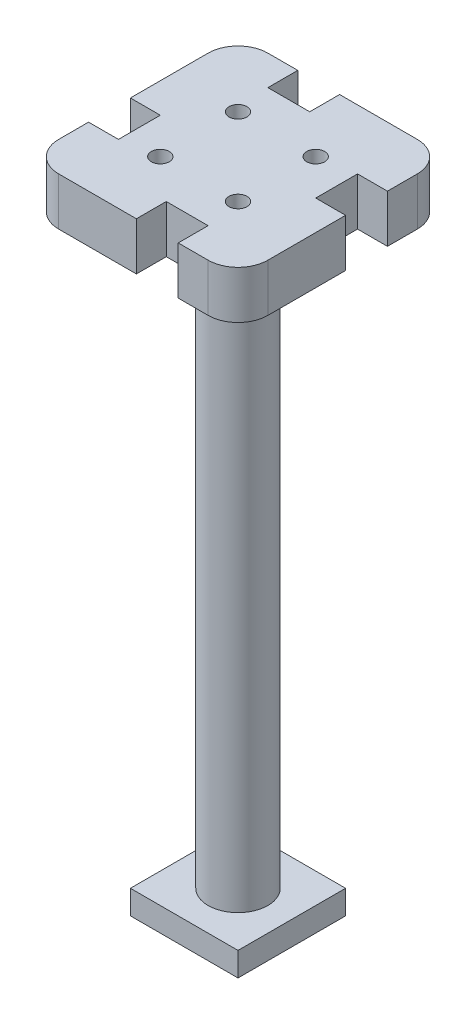
ISO-10303-21;
HEADER;
FILE_DESCRIPTION(('STEP AP214'),'2;1');
FILE_NAME('part.step','',(''),(''),'','','');
FILE_SCHEMA(('AUTOMOTIVE_DESIGN { 1 0 10303 214 1 1 1 1 }'));
ENDSEC;
DATA;
#1=APPLICATION_CONTEXT('core data for automotive mechanical design processes');
#2=APPLICATION_PROTOCOL_DEFINITION('international standard','automotive_design',2000,#1);
#3=PRODUCT_CONTEXT('',#1,'mechanical');
#4=PRODUCT('Part','Part','',(#3));
#5=PRODUCT_RELATED_PRODUCT_CATEGORY('part','',(#4));
#6=PRODUCT_DEFINITION_FORMATION('','',#4);
#7=PRODUCT_DEFINITION_CONTEXT('part definition',#1,'design');
#8=PRODUCT_DEFINITION('design','',#6,#7);
#9=PRODUCT_DEFINITION_SHAPE('','',#8);
#10=(LENGTH_UNIT() NAMED_UNIT(*) SI_UNIT(.MILLI.,.METRE.));
#11=(NAMED_UNIT(*) PLANE_ANGLE_UNIT() SI_UNIT($,.RADIAN.));
#12=(NAMED_UNIT(*) SI_UNIT($,.STERADIAN.) SOLID_ANGLE_UNIT());
#13=UNCERTAINTY_MEASURE_WITH_UNIT(LENGTH_MEASURE(1.E-05),#10,'distance_accuracy_value','');
#14=(GEOMETRIC_REPRESENTATION_CONTEXT(3) GLOBAL_UNCERTAINTY_ASSIGNED_CONTEXT((#13)) GLOBAL_UNIT_ASSIGNED_CONTEXT((#10,
#11,#12)) REPRESENTATION_CONTEXT('',''));
#15=CARTESIAN_POINT('',(0.,0.,0.));
#16=DIRECTION('',(0.,0.,1.));
#17=DIRECTION('',(1.,0.,0.));
#18=AXIS2_PLACEMENT_3D('',#15,#16,#17);
#19=CARTESIAN_POINT('',(0.,8.,0.));
#20=DIRECTION('',(1.,0.,0.));
#21=DIRECTION('',(0.,0.,-1.));
#22=AXIS2_PLACEMENT_3D('',#19,#20,#21);
#23=PLANE('',#22);
#24=DIRECTION('',(0.,0.,1.));
#25=VECTOR('',#24,1.);
#26=CARTESIAN_POINT('',(0.,0.,0.));
#27=LINE('',#26,#25);
#28=CARTESIAN_POINT('',(0.,0.,-10.));
#29=VERTEX_POINT('',#28);
#30=CARTESIAN_POINT('',(0.,0.,-5.));
#31=VERTEX_POINT('',#30);
#32=EDGE_CURVE('E296',#29,#31,#27,.T.);
#33=ORIENTED_EDGE('',*,*,#32,.T.);
#34=DIRECTION('',(0.,-1.,0.));
#35=VECTOR('',#34,1.);
#36=CARTESIAN_POINT('',(0.,8.,-5.));
#37=LINE('',#36,#35);
#38=CARTESIAN_POINT('',(0.,8.,-5.));
#39=VERTEX_POINT('',#38);
#40=EDGE_CURVE('E11',#31,#39,#37,.F.);
#41=ORIENTED_EDGE('',*,*,#40,.T.);
#42=DIRECTION('',(0.,0.,1.));
#43=VECTOR('',#42,1.);
#44=CARTESIAN_POINT('',(0.,8.,0.));
#45=LINE('',#44,#43);
#46=CARTESIAN_POINT('',(0.,8.,-10.));
#47=VERTEX_POINT('',#46);
#48=EDGE_CURVE('E409',#47,#39,#45,.T.);
#49=ORIENTED_EDGE('',*,*,#48,.F.);
#50=DIRECTION('',(0.,-1.,0.));
#51=VECTOR('',#50,1.);
#52=CARTESIAN_POINT('',(0.,8.,-10.));
#53=LINE('',#52,#51);
#54=EDGE_CURVE('E401',#47,#29,#53,.T.);
#55=ORIENTED_EDGE('',*,*,#54,.T.);
#56=EDGE_LOOP('',(#33,#41,#49,#55));
#57=FACE_BOUND('',#56,.T.);
#58=ADVANCED_FACE('F41',(#57),#23,.F.);
#59=CARTESIAN_POINT('',(0.,8.,0.));
#60=DIRECTION('',(0.,0.,-1.));
#61=DIRECTION('',(-1.,0.,0.));
#62=AXIS2_PLACEMENT_3D('',#59,#60,#61);
#63=PLANE('',#62);
#64=DIRECTION('',(1.,0.,0.));
#65=VECTOR('',#64,1.);
#66=CARTESIAN_POINT('',(0.,0.,0.));
#67=LINE('',#66,#65);
#68=CARTESIAN_POINT('',(25.,0.,0.));
#69=VERTEX_POINT('',#68);
#70=CARTESIAN_POINT('',(30.,0.,0.));
#71=VERTEX_POINT('',#70);
#72=EDGE_CURVE('E421',#69,#71,#67,.T.);
#73=ORIENTED_EDGE('',*,*,#72,.T.);
#74=DIRECTION('',(0.,-1.,0.));
#75=VECTOR('',#74,1.);
#76=CARTESIAN_POINT('',(30.,8.,0.));
#77=LINE('',#76,#75);
#78=CARTESIAN_POINT('',(30.,8.,0.));
#79=VERTEX_POINT('',#78);
#80=EDGE_CURVE('E440',#71,#79,#77,.F.);
#81=ORIENTED_EDGE('',*,*,#80,.T.);
#82=DIRECTION('',(1.,0.,0.));
#83=VECTOR('',#82,1.);
#84=CARTESIAN_POINT('',(0.,8.,0.));
#85=LINE('',#84,#83);
#86=CARTESIAN_POINT('',(25.,8.,0.));
#87=VERTEX_POINT('',#86);
#88=EDGE_CURVE('E408',#87,#79,#85,.T.);
#89=ORIENTED_EDGE('',*,*,#88,.F.);
#90=DIRECTION('',(0.,-1.,0.));
#91=VECTOR('',#90,1.);
#92=CARTESIAN_POINT('',(25.,8.,0.));
#93=LINE('',#92,#91);
#94=EDGE_CURVE('E331',#87,#69,#93,.T.);
#95=ORIENTED_EDGE('',*,*,#94,.T.);
#96=EDGE_LOOP('',(#73,#81,#89,#95));
#97=FACE_BOUND('',#96,.T.);
#98=ADVANCED_FACE('F488',(#97),#63,.F.);
#99=CARTESIAN_POINT('',(35.,8.,0.));
#100=DIRECTION('',(-1.,0.,0.));
#101=DIRECTION('',(0.,0.,1.));
#102=AXIS2_PLACEMENT_3D('',#99,#100,#101);
#103=PLANE('',#102);
#104=DIRECTION('',(0.,0.,-1.));
#105=VECTOR('',#104,1.);
#106=CARTESIAN_POINT('',(35.,0.,0.));
#107=LINE('',#106,#105);
#108=CARTESIAN_POINT('',(35.,0.,-25.));
#109=VERTEX_POINT('',#108);
#110=CARTESIAN_POINT('',(35.,0.,-30.));
#111=VERTEX_POINT('',#110);
#112=EDGE_CURVE('E424',#109,#111,#107,.T.);
#113=ORIENTED_EDGE('',*,*,#112,.T.);
#114=DIRECTION('',(0.,-1.,0.));
#115=VECTOR('',#114,1.);
#116=CARTESIAN_POINT('',(35.,8.,-30.));
#117=LINE('',#116,#115);
#118=CARTESIAN_POINT('',(35.,8.,-30.));
#119=VERTEX_POINT('',#118);
#120=EDGE_CURVE('E452',#111,#119,#117,.F.);
#121=ORIENTED_EDGE('',*,*,#120,.T.);
#122=DIRECTION('',(0.,0.,-1.));
#123=VECTOR('',#122,1.);
#124=CARTESIAN_POINT('',(35.,8.,0.));
#125=LINE('',#124,#123);
#126=CARTESIAN_POINT('',(35.,8.,-25.));
#127=VERTEX_POINT('',#126);
#128=EDGE_CURVE('E412',#127,#119,#125,.T.);
#129=ORIENTED_EDGE('',*,*,#128,.F.);
#130=DIRECTION('',(0.,-1.,0.));
#131=VECTOR('',#130,1.);
#132=CARTESIAN_POINT('',(35.,8.,-25.));
#133=LINE('',#132,#131);
#134=EDGE_CURVE('E297',#127,#109,#133,.T.);
#135=ORIENTED_EDGE('',*,*,#134,.T.);
#136=EDGE_LOOP('',(#113,#121,#129,#135));
#137=FACE_BOUND('',#136,.T.);
#138=ADVANCED_FACE('F514',(#137),#103,.F.);
#139=CARTESIAN_POINT('',(0.,8.,-35.));
#140=DIRECTION('',(0.,0.,1.));
#141=DIRECTION('',(1.,0.,0.));
#142=AXIS2_PLACEMENT_3D('',#139,#140,#141);
#143=PLANE('',#142);
#144=DIRECTION('',(-1.,0.,0.));
#145=VECTOR('',#144,1.);
#146=CARTESIAN_POINT('',(0.,0.,-35.));
#147=LINE('',#146,#145);
#148=CARTESIAN_POINT('',(9.99999999999999,0.,-35.));
#149=VERTEX_POINT('',#148);
#150=CARTESIAN_POINT('',(4.99999999999999,0.,-35.));
#151=VERTEX_POINT('',#150);
#152=EDGE_CURVE('E427',#149,#151,#147,.T.);
#153=ORIENTED_EDGE('',*,*,#152,.T.);
#154=DIRECTION('',(0.,-1.,0.));
#155=VECTOR('',#154,1.);
#156=CARTESIAN_POINT('',(4.99999999999999,8.,-35.));
#157=LINE('',#156,#155);
#158=CARTESIAN_POINT('',(4.99999999999999,8.,-35.));
#159=VERTEX_POINT('',#158);
#160=EDGE_CURVE('E457',#151,#159,#157,.F.);
#161=ORIENTED_EDGE('',*,*,#160,.T.);
#162=DIRECTION('',(-1.,0.,0.));
#163=VECTOR('',#162,1.);
#164=CARTESIAN_POINT('',(0.,8.,-35.));
#165=LINE('',#164,#163);
#166=CARTESIAN_POINT('',(9.99999999999999,8.,-35.));
#167=VERTEX_POINT('',#166);
#168=EDGE_CURVE('E415',#167,#159,#165,.T.);
#169=ORIENTED_EDGE('',*,*,#168,.F.);
#170=DIRECTION('',(0.,-1.,0.));
#171=VECTOR('',#170,1.);
#172=CARTESIAN_POINT('',(9.99999999999999,8.,-35.));
#173=LINE('',#172,#171);
#174=EDGE_CURVE('E288',#167,#149,#173,.T.);
#175=ORIENTED_EDGE('',*,*,#174,.T.);
#176=EDGE_LOOP('',(#153,#161,#169,#175));
#177=FACE_BOUND('',#176,.T.);
#178=ADVANCED_FACE('F543',(#177),#143,.F.);
#179=CARTESIAN_POINT('',(0.,8.,0.));
#180=DIRECTION('',(0.,-1.,0.));
#181=DIRECTION('',(0.,0.,-1.));
#182=AXIS2_PLACEMENT_3D('',#179,#180,#181);
#183=PLANE('',#182);
#184=CARTESIAN_POINT('',(24.,8.,-11.));
#185=DIRECTION('',(0.,-1.,0.));
#186=DIRECTION('',(0.,0.,-1.));
#187=AXIS2_PLACEMENT_3D('',#184,#185,#186);
#188=CIRCLE('',#187,1.5);
#189=CARTESIAN_POINT('',(24.,8.,-12.5));
#190=VERTEX_POINT('',#189);
#191=EDGE_CURVE('E310',#190,#190,#188,.T.);
#192=ORIENTED_EDGE('',*,*,#191,.T.);
#193=EDGE_LOOP('',(#192));
#194=FACE_BOUND('',#193,.T.);
#195=CARTESIAN_POINT('',(11.,8.,-24.));
#196=DIRECTION('',(0.,-1.,0.));
#197=DIRECTION('',(0.,0.,-1.));
#198=AXIS2_PLACEMENT_3D('',#195,#196,#197);
#199=CIRCLE('',#198,1.5);
#200=CARTESIAN_POINT('',(11.,8.,-25.5));
#201=VERTEX_POINT('',#200);
#202=EDGE_CURVE('E317',#201,#201,#199,.T.);
#203=ORIENTED_EDGE('',*,*,#202,.T.);
#204=EDGE_LOOP('',(#203));
#205=FACE_BOUND('',#204,.T.);
#206=CARTESIAN_POINT('',(24.,8.,-24.));
#207=DIRECTION('',(0.,-1.,0.));
#208=DIRECTION('',(0.,0.,-1.));
#209=AXIS2_PLACEMENT_3D('',#206,#207,#208);
#210=CIRCLE('',#209,1.5);
#211=CARTESIAN_POINT('',(24.,8.,-25.5));
#212=VERTEX_POINT('',#211);
#213=EDGE_CURVE('E304',#212,#212,#210,.T.);
#214=ORIENTED_EDGE('',*,*,#213,.T.);
#215=EDGE_LOOP('',(#214));
#216=FACE_BOUND('',#215,.T.);
#217=CARTESIAN_POINT('',(11.,8.,-11.));
#218=DIRECTION('',(0.,-1.,0.));
#219=DIRECTION('',(0.,0.,-1.));
#220=AXIS2_PLACEMENT_3D('',#217,#218,#219);
#221=CIRCLE('',#220,1.5);
#222=CARTESIAN_POINT('',(11.,8.,-12.5));
#223=VERTEX_POINT('',#222);
#224=EDGE_CURVE('E336',#223,#223,#221,.T.);
#225=ORIENTED_EDGE('',*,*,#224,.T.);
#226=EDGE_LOOP('',(#225));
#227=FACE_BOUND('',#226,.T.);
#228=ORIENTED_EDGE('',*,*,#88,.T.);
#229=CARTESIAN_POINT('',(30.,8.,-5.));
#230=DIRECTION('',(0.,-1.,0.));
#231=DIRECTION('',(0.,0.,-1.));
#232=AXIS2_PLACEMENT_3D('',#229,#230,#231);
#233=CIRCLE('',#232,5.);
#234=CARTESIAN_POINT('',(35.,8.,-5.));
#235=VERTEX_POINT('',#234);
#236=EDGE_CURVE('E447',#79,#235,#233,.F.);
#237=ORIENTED_EDGE('',*,*,#236,.T.);
#238=CARTESIAN_POINT('',(35.,8.,-18.));
#239=VERTEX_POINT('',#238);
#240=EDGE_CURVE('E413',#235,#239,#125,.T.);
#241=ORIENTED_EDGE('',*,*,#240,.T.);
#242=DIRECTION('',(-1.,0.,0.));
#243=VECTOR('',#242,1.);
#244=CARTESIAN_POINT('',(0.,8.,-18.));
#245=LINE('',#244,#243);
#246=CARTESIAN_POINT('',(30.,8.,-18.));
#247=VERTEX_POINT('',#246);
#248=EDGE_CURVE('E275',#239,#247,#245,.T.);
#249=ORIENTED_EDGE('',*,*,#248,.T.);
#250=DIRECTION('',(0.,0.,-1.));
#251=VECTOR('',#250,1.);
#252=CARTESIAN_POINT('',(30.,8.,0.));
#253=LINE('',#252,#251);
#254=CARTESIAN_POINT('',(30.,8.,-25.));
#255=VERTEX_POINT('',#254);
#256=EDGE_CURVE('E278',#247,#255,#253,.T.);
#257=ORIENTED_EDGE('',*,*,#256,.T.);
#258=DIRECTION('',(-1.,0.,0.));
#259=VECTOR('',#258,1.);
#260=CARTESIAN_POINT('',(0.,8.,-25.));
#261=LINE('',#260,#259);
#262=EDGE_CURVE('E282',#127,#255,#261,.T.);
#263=ORIENTED_EDGE('',*,*,#262,.F.);
#264=ORIENTED_EDGE('',*,*,#128,.T.);
#265=CARTESIAN_POINT('',(30.,8.,-30.));
#266=DIRECTION('',(0.,-1.,0.));
#267=DIRECTION('',(0.,0.,-1.));
#268=AXIS2_PLACEMENT_3D('',#265,#266,#267);
#269=CIRCLE('',#268,5.);
#270=CARTESIAN_POINT('',(30.,8.,-35.));
#271=VERTEX_POINT('',#270);
#272=EDGE_CURVE('E445',#119,#271,#269,.F.);
#273=ORIENTED_EDGE('',*,*,#272,.T.);
#274=CARTESIAN_POINT('',(17.,8.,-35.));
#275=VERTEX_POINT('',#274);
#276=EDGE_CURVE('E416',#271,#275,#165,.T.);
#277=ORIENTED_EDGE('',*,*,#276,.T.);
#278=DIRECTION('',(0.,0.,1.));
#279=VECTOR('',#278,1.);
#280=CARTESIAN_POINT('',(17.,8.,0.));
#281=LINE('',#280,#279);
#282=CARTESIAN_POINT('',(17.,8.,-30.));
#283=VERTEX_POINT('',#282);
#284=EDGE_CURVE('E355',#275,#283,#281,.T.);
#285=ORIENTED_EDGE('',*,*,#284,.T.);
#286=DIRECTION('',(1.,0.,0.));
#287=VECTOR('',#286,1.);
#288=CARTESIAN_POINT('',(0.,8.,-30.));
#289=LINE('',#288,#287);
#290=CARTESIAN_POINT('',(9.99999999999999,8.,-30.));
#291=VERTEX_POINT('',#290);
#292=EDGE_CURVE('E358',#291,#283,#289,.T.);
#293=ORIENTED_EDGE('',*,*,#292,.F.);
#294=DIRECTION('',(0.,0.,1.));
#295=VECTOR('',#294,1.);
#296=CARTESIAN_POINT('',(9.99999999999998,8.,0.));
#297=LINE('',#296,#295);
#298=EDGE_CURVE('E361',#167,#291,#297,.T.);
#299=ORIENTED_EDGE('',*,*,#298,.F.);
#300=ORIENTED_EDGE('',*,*,#168,.T.);
#301=CARTESIAN_POINT('',(4.99999999999999,8.,-30.));
#302=DIRECTION('',(0.,-1.,0.));
#303=DIRECTION('',(0.,0.,-1.));
#304=AXIS2_PLACEMENT_3D('',#301,#302,#303);
#305=CIRCLE('',#304,5.);
#306=CARTESIAN_POINT('',(0.,8.,-30.));
#307=VERTEX_POINT('',#306);
#308=EDGE_CURVE('E443',#159,#307,#305,.F.);
#309=ORIENTED_EDGE('',*,*,#308,.T.);
#310=CARTESIAN_POINT('',(0.,8.,-17.));
#311=VERTEX_POINT('',#310);
#312=EDGE_CURVE('E406',#307,#311,#45,.T.);
#313=ORIENTED_EDGE('',*,*,#312,.T.);
#314=DIRECTION('',(1.,0.,0.));
#315=VECTOR('',#314,1.);
#316=CARTESIAN_POINT('',(0.,8.,-17.));
#317=LINE('',#316,#315);
#318=CARTESIAN_POINT('',(4.99999999999999,8.,-17.));
#319=VERTEX_POINT('',#318);
#320=EDGE_CURVE('E386',#311,#319,#317,.T.);
#321=ORIENTED_EDGE('',*,*,#320,.T.);
#322=DIRECTION('',(0.,0.,-1.));
#323=VECTOR('',#322,1.);
#324=CARTESIAN_POINT('',(4.99999999999999,8.,0.));
#325=LINE('',#324,#323);
#326=CARTESIAN_POINT('',(4.99999999999999,8.,-10.));
#327=VERTEX_POINT('',#326);
#328=EDGE_CURVE('E381',#327,#319,#325,.T.);
#329=ORIENTED_EDGE('',*,*,#328,.F.);
#330=DIRECTION('',(1.,0.,0.));
#331=VECTOR('',#330,1.);
#332=CARTESIAN_POINT('',(0.,8.,-10.));
#333=LINE('',#332,#331);
#334=EDGE_CURVE('E383',#47,#327,#333,.T.);
#335=ORIENTED_EDGE('',*,*,#334,.F.);
#336=ORIENTED_EDGE('',*,*,#48,.T.);
#337=CARTESIAN_POINT('',(5.,8.,-5.));
#338=DIRECTION('',(0.,-1.,0.));
#339=DIRECTION('',(0.,0.,-1.));
#340=AXIS2_PLACEMENT_3D('',#337,#338,#339);
#341=CIRCLE('',#340,5.);
#342=CARTESIAN_POINT('',(5.,8.,0.));
#343=VERTEX_POINT('',#342);
#344=EDGE_CURVE('E56',#39,#343,#341,.F.);
#345=ORIENTED_EDGE('',*,*,#344,.T.);
#346=CARTESIAN_POINT('',(18.,8.,0.));
#347=VERTEX_POINT('',#346);
#348=EDGE_CURVE('E410',#343,#347,#85,.T.);
#349=ORIENTED_EDGE('',*,*,#348,.T.);
#350=DIRECTION('',(0.,0.,-1.));
#351=VECTOR('',#350,1.);
#352=CARTESIAN_POINT('',(18.,8.,0.));
#353=LINE('',#352,#351);
#354=CARTESIAN_POINT('',(18.,8.,-5.));
#355=VERTEX_POINT('',#354);
#356=EDGE_CURVE('E324',#347,#355,#353,.T.);
#357=ORIENTED_EDGE('',*,*,#356,.T.);
#358=DIRECTION('',(1.,0.,0.));
#359=VECTOR('',#358,1.);
#360=CARTESIAN_POINT('',(0.,8.,-5.));
#361=LINE('',#360,#359);
#362=CARTESIAN_POINT('',(25.,8.,-5.));
#363=VERTEX_POINT('',#362);
#364=EDGE_CURVE('E328',#355,#363,#361,.T.);
#365=ORIENTED_EDGE('',*,*,#364,.T.);
#366=DIRECTION('',(0.,0.,-1.));
#367=VECTOR('',#366,1.);
#368=CARTESIAN_POINT('',(25.,8.,0.));
#369=LINE('',#368,#367);
#370=EDGE_CURVE('E322',#87,#363,#369,.T.);
#371=ORIENTED_EDGE('',*,*,#370,.F.);
#372=EDGE_LOOP('',(#228,#237,#241,#249,#257,#263,#264,#273,#277,#285,#293,#299,#300,#309,#313,
#321,#329,#335,#336,#345,#349,#357,#365,#371));
#373=FACE_BOUND('',#372,.T.);
#374=ADVANCED_FACE('F477',(#194,#205,#216,#227,#373),#183,.F.);
#375=CARTESIAN_POINT('',(0.,0.,0.));
#376=DIRECTION('',(0.,-1.,0.));
#377=DIRECTION('',(0.,0.,-1.));
#378=AXIS2_PLACEMENT_3D('',#375,#376,#377);
#379=PLANE('',#378);
#380=CARTESIAN_POINT('',(17.5,0.,-17.5));
#381=DIRECTION('',(0.,-1.,0.));
#382=DIRECTION('',(0.,0.,-1.));
#383=AXIS2_PLACEMENT_3D('',#380,#381,#382);
#384=CIRCLE('',#383,5.);
#385=CARTESIAN_POINT('',(17.5,0.,-22.5));
#386=VERTEX_POINT('',#385);
#387=EDGE_CURVE('E251',#386,#386,#384,.T.);
#388=ORIENTED_EDGE('',*,*,#387,.F.);
#389=EDGE_LOOP('',(#388));
#390=FACE_BOUND('',#389,.T.);
#391=CARTESIAN_POINT('',(5.99999999999998,0.,-29.));
#392=DIRECTION('',(0.,-1.,0.));
#393=DIRECTION('',(0.,0.,-1.));
#394=AXIS2_PLACEMENT_3D('',#391,#392,#393);
#395=CIRCLE('',#394,4.);
#396=CARTESIAN_POINT('',(5.99999999999998,0.,-33.));
#397=VERTEX_POINT('',#396);
#398=EDGE_CURVE('E267',#397,#397,#395,.T.);
#399=ORIENTED_EDGE('',*,*,#398,.F.);
#400=EDGE_LOOP('',(#399));
#401=FACE_BOUND('',#400,.T.);
#402=CARTESIAN_POINT('',(29.,0.,-6.));
#403=DIRECTION('',(0.,-1.,0.));
#404=DIRECTION('',(0.,0.,-1.));
#405=AXIS2_PLACEMENT_3D('',#402,#403,#404);
#406=CIRCLE('',#405,4.00000000000001);
#407=CARTESIAN_POINT('',(29.,0.,-10.));
#408=VERTEX_POINT('',#407);
#409=EDGE_CURVE('E270',#408,#408,#406,.T.);
#410=ORIENTED_EDGE('',*,*,#409,.F.);
#411=EDGE_LOOP('',(#410));
#412=FACE_BOUND('',#411,.T.);
#413=CARTESIAN_POINT('',(35.,0.,-5.));
#414=VERTEX_POINT('',#413);
#415=CARTESIAN_POINT('',(35.,0.,-18.));
#416=VERTEX_POINT('',#415);
#417=EDGE_CURVE('E425',#414,#416,#107,.T.);
#418=ORIENTED_EDGE('',*,*,#417,.F.);
#419=CARTESIAN_POINT('',(30.,0.,-5.));
#420=DIRECTION('',(0.,-1.,0.));
#421=DIRECTION('',(0.,0.,-1.));
#422=AXIS2_PLACEMENT_3D('',#419,#420,#421);
#423=CIRCLE('',#422,5.);
#424=EDGE_CURVE('E438',#414,#71,#423,.T.);
#425=ORIENTED_EDGE('',*,*,#424,.T.);
#426=ORIENTED_EDGE('',*,*,#72,.F.);
#427=DIRECTION('',(0.,0.,-1.));
#428=VECTOR('',#427,1.);
#429=CARTESIAN_POINT('',(25.,0.,0.));
#430=LINE('',#429,#428);
#431=CARTESIAN_POINT('',(25.,0.,-5.));
#432=VERTEX_POINT('',#431);
#433=EDGE_CURVE('E332',#69,#432,#430,.T.);
#434=ORIENTED_EDGE('',*,*,#433,.T.);
#435=DIRECTION('',(1.,0.,0.));
#436=VECTOR('',#435,1.);
#437=CARTESIAN_POINT('',(0.,0.,-5.));
#438=LINE('',#437,#436);
#439=CARTESIAN_POINT('',(18.,0.,-5.));
#440=VERTEX_POINT('',#439);
#441=EDGE_CURVE('E325',#440,#432,#438,.T.);
#442=ORIENTED_EDGE('',*,*,#441,.F.);
#443=DIRECTION('',(0.,0.,-1.));
#444=VECTOR('',#443,1.);
#445=CARTESIAN_POINT('',(18.,0.,0.));
#446=LINE('',#445,#444);
#447=CARTESIAN_POINT('',(18.,0.,0.));
#448=VERTEX_POINT('',#447);
#449=EDGE_CURVE('E335',#448,#440,#446,.T.);
#450=ORIENTED_EDGE('',*,*,#449,.F.);
#451=CARTESIAN_POINT('',(5.,0.,0.));
#452=VERTEX_POINT('',#451);
#453=EDGE_CURVE('E422',#452,#448,#67,.T.);
#454=ORIENTED_EDGE('',*,*,#453,.F.);
#455=CARTESIAN_POINT('',(5.,0.,-5.));
#456=DIRECTION('',(0.,-1.,0.));
#457=DIRECTION('',(0.,0.,-1.));
#458=AXIS2_PLACEMENT_3D('',#455,#456,#457);
#459=CIRCLE('',#458,5.);
#460=EDGE_CURVE('E432',#452,#31,#459,.T.);
#461=ORIENTED_EDGE('',*,*,#460,.T.);
#462=ORIENTED_EDGE('',*,*,#32,.F.);
#463=DIRECTION('',(1.,0.,0.));
#464=VECTOR('',#463,1.);
#465=CARTESIAN_POINT('',(0.,0.,-10.));
#466=LINE('',#465,#464);
#467=CARTESIAN_POINT('',(4.99999999999999,0.,-10.));
#468=VERTEX_POINT('',#467);
#469=EDGE_CURVE('E392',#29,#468,#466,.T.);
#470=ORIENTED_EDGE('',*,*,#469,.T.);
#471=DIRECTION('',(0.,0.,-1.));
#472=VECTOR('',#471,1.);
#473=CARTESIAN_POINT('',(4.99999999999999,0.,0.));
#474=LINE('',#473,#472);
#475=CARTESIAN_POINT('',(4.99999999999999,0.,-17.));
#476=VERTEX_POINT('',#475);
#477=EDGE_CURVE('E343',#468,#476,#474,.T.);
#478=ORIENTED_EDGE('',*,*,#477,.T.);
#479=DIRECTION('',(1.,0.,0.));
#480=VECTOR('',#479,1.);
#481=CARTESIAN_POINT('',(0.,0.,-17.));
#482=LINE('',#481,#480);
#483=CARTESIAN_POINT('',(0.,0.,-17.));
#484=VERTEX_POINT('',#483);
#485=EDGE_CURVE('E384',#484,#476,#482,.T.);
#486=ORIENTED_EDGE('',*,*,#485,.F.);
#487=CARTESIAN_POINT('',(0.,0.,-30.));
#488=VERTEX_POINT('',#487);
#489=EDGE_CURVE('E419',#488,#484,#27,.T.);
#490=ORIENTED_EDGE('',*,*,#489,.F.);
#491=CARTESIAN_POINT('',(4.99999999999999,0.,-30.));
#492=DIRECTION('',(0.,-1.,0.));
#493=DIRECTION('',(0.,0.,-1.));
#494=AXIS2_PLACEMENT_3D('',#491,#492,#493);
#495=CIRCLE('',#494,5.);
#496=EDGE_CURVE('E434',#488,#151,#495,.T.);
#497=ORIENTED_EDGE('',*,*,#496,.T.);
#498=ORIENTED_EDGE('',*,*,#152,.F.);
#499=DIRECTION('',(0.,0.,1.));
#500=VECTOR('',#499,1.);
#501=CARTESIAN_POINT('',(9.99999999999998,0.,0.));
#502=LINE('',#501,#500);
#503=CARTESIAN_POINT('',(9.99999999999999,0.,-30.));
#504=VERTEX_POINT('',#503);
#505=EDGE_CURVE('E359',#149,#504,#502,.T.);
#506=ORIENTED_EDGE('',*,*,#505,.T.);
#507=DIRECTION('',(1.,0.,0.));
#508=VECTOR('',#507,1.);
#509=CARTESIAN_POINT('',(0.,0.,-30.));
#510=LINE('',#509,#508);
#511=CARTESIAN_POINT('',(17.,0.,-30.));
#512=VERTEX_POINT('',#511);
#513=EDGE_CURVE('E367',#504,#512,#510,.T.);
#514=ORIENTED_EDGE('',*,*,#513,.T.);
#515=DIRECTION('',(0.,0.,1.));
#516=VECTOR('',#515,1.);
#517=CARTESIAN_POINT('',(17.,0.,0.));
#518=LINE('',#517,#516);
#519=CARTESIAN_POINT('',(17.,0.,-35.));
#520=VERTEX_POINT('',#519);
#521=EDGE_CURVE('E364',#520,#512,#518,.T.);
#522=ORIENTED_EDGE('',*,*,#521,.F.);
#523=CARTESIAN_POINT('',(30.,0.,-35.));
#524=VERTEX_POINT('',#523);
#525=EDGE_CURVE('E428',#524,#520,#147,.T.);
#526=ORIENTED_EDGE('',*,*,#525,.F.);
#527=CARTESIAN_POINT('',(30.,0.,-30.));
#528=DIRECTION('',(0.,-1.,0.));
#529=DIRECTION('',(0.,0.,-1.));
#530=AXIS2_PLACEMENT_3D('',#527,#528,#529);
#531=CIRCLE('',#530,5.);
#532=EDGE_CURVE('E436',#524,#111,#531,.T.);
#533=ORIENTED_EDGE('',*,*,#532,.T.);
#534=ORIENTED_EDGE('',*,*,#112,.F.);
#535=DIRECTION('',(-1.,0.,0.));
#536=VECTOR('',#535,1.);
#537=CARTESIAN_POINT('',(0.,0.,-25.));
#538=LINE('',#537,#536);
#539=CARTESIAN_POINT('',(30.,0.,-25.));
#540=VERTEX_POINT('',#539);
#541=EDGE_CURVE('E279',#109,#540,#538,.T.);
#542=ORIENTED_EDGE('',*,*,#541,.T.);
#543=DIRECTION('',(0.,0.,-1.));
#544=VECTOR('',#543,1.);
#545=CARTESIAN_POINT('',(30.,0.,0.));
#546=LINE('',#545,#544);
#547=CARTESIAN_POINT('',(30.,0.,-18.));
#548=VERTEX_POINT('',#547);
#549=EDGE_CURVE('E287',#548,#540,#546,.T.);
#550=ORIENTED_EDGE('',*,*,#549,.F.);
#551=DIRECTION('',(-1.,0.,0.));
#552=VECTOR('',#551,1.);
#553=CARTESIAN_POINT('',(0.,0.,-18.));
#554=LINE('',#553,#552);
#555=EDGE_CURVE('E285',#416,#548,#554,.T.);
#556=ORIENTED_EDGE('',*,*,#555,.F.);
#557=EDGE_LOOP('',(#418,#425,#426,#434,#442,#450,#454,#461,#462,#470,#478,#486,#490,#497,#498,
#506,#514,#522,#526,#533,#534,#542,#550,#556));
#558=FACE_BOUND('',#557,.T.);
#559=CARTESIAN_POINT('',(24.,0.,-11.));
#560=DIRECTION('',(0.,-1.,0.));
#561=DIRECTION('',(0.,0.,-1.));
#562=AXIS2_PLACEMENT_3D('',#559,#560,#561);
#563=CIRCLE('',#562,1.5);
#564=CARTESIAN_POINT('',(24.,0.,-12.5));
#565=VERTEX_POINT('',#564);
#566=EDGE_CURVE('E314',#565,#565,#563,.T.);
#567=ORIENTED_EDGE('',*,*,#566,.F.);
#568=EDGE_LOOP('',(#567));
#569=FACE_BOUND('',#568,.T.);
#570=CARTESIAN_POINT('',(11.,0.,-24.));
#571=DIRECTION('',(0.,-1.,0.));
#572=DIRECTION('',(0.,0.,-1.));
#573=AXIS2_PLACEMENT_3D('',#570,#571,#572);
#574=CIRCLE('',#573,1.5);
#575=CARTESIAN_POINT('',(11.,0.,-25.5));
#576=VERTEX_POINT('',#575);
#577=EDGE_CURVE('E307',#576,#576,#574,.T.);
#578=ORIENTED_EDGE('',*,*,#577,.F.);
#579=EDGE_LOOP('',(#578));
#580=FACE_BOUND('',#579,.T.);
#581=CARTESIAN_POINT('',(24.,0.,-24.));
#582=DIRECTION('',(0.,-1.,0.));
#583=DIRECTION('',(0.,0.,-1.));
#584=AXIS2_PLACEMENT_3D('',#581,#582,#583);
#585=CIRCLE('',#584,1.5);
#586=CARTESIAN_POINT('',(24.,0.,-25.5));
#587=VERTEX_POINT('',#586);
#588=EDGE_CURVE('E266',#587,#587,#585,.T.);
#589=ORIENTED_EDGE('',*,*,#588,.F.);
#590=EDGE_LOOP('',(#589));
#591=FACE_BOUND('',#590,.T.);
#592=CARTESIAN_POINT('',(11.,0.,-11.));
#593=DIRECTION('',(0.,-1.,0.));
#594=DIRECTION('',(0.,0.,-1.));
#595=AXIS2_PLACEMENT_3D('',#592,#593,#594);
#596=CIRCLE('',#595,1.5);
#597=CARTESIAN_POINT('',(11.,0.,-12.5));
#598=VERTEX_POINT('',#597);
#599=EDGE_CURVE('E313',#598,#598,#596,.T.);
#600=ORIENTED_EDGE('',*,*,#599,.F.);
#601=EDGE_LOOP('',(#600));
#602=FACE_BOUND('',#601,.T.);
#603=ADVANCED_FACE('F468',(#390,#401,#412,#558,#569,#580,#591,#602),#379,.T.);
#604=ORIENTED_EDGE('',*,*,#312,.F.);
#605=DIRECTION('',(0.,-1.,0.));
#606=VECTOR('',#605,1.);
#607=CARTESIAN_POINT('',(0.,8.,-30.));
#608=LINE('',#607,#606);
#609=EDGE_CURVE('E454',#307,#488,#608,.T.);
#610=ORIENTED_EDGE('',*,*,#609,.T.);
#611=ORIENTED_EDGE('',*,*,#489,.T.);
#612=DIRECTION('',(0.,-1.,0.));
#613=VECTOR('',#612,1.);
#614=CARTESIAN_POINT('',(0.,8.,-17.));
#615=LINE('',#614,#613);
#616=EDGE_CURVE('E398',#311,#484,#615,.T.);
#617=ORIENTED_EDGE('',*,*,#616,.F.);
#618=EDGE_LOOP('',(#604,#610,#611,#617));
#619=FACE_BOUND('',#618,.T.);
#620=ADVANCED_FACE('F552',(#619),#23,.F.);
#621=ORIENTED_EDGE('',*,*,#348,.F.);
#622=DIRECTION('',(0.,-1.,0.));
#623=VECTOR('',#622,1.);
#624=CARTESIAN_POINT('',(5.,8.,0.));
#625=LINE('',#624,#623);
#626=EDGE_CURVE('E49',#343,#452,#625,.T.);
#627=ORIENTED_EDGE('',*,*,#626,.T.);
#628=ORIENTED_EDGE('',*,*,#453,.T.);
#629=DIRECTION('',(0.,-1.,0.));
#630=VECTOR('',#629,1.);
#631=CARTESIAN_POINT('',(18.,8.,0.));
#632=LINE('',#631,#630);
#633=EDGE_CURVE('E346',#347,#448,#632,.T.);
#634=ORIENTED_EDGE('',*,*,#633,.F.);
#635=EDGE_LOOP('',(#621,#627,#628,#634));
#636=FACE_BOUND('',#635,.T.);
#637=ADVANCED_FACE('F462',(#636),#63,.F.);
#638=ORIENTED_EDGE('',*,*,#240,.F.);
#639=DIRECTION('',(0.,-1.,0.));
#640=VECTOR('',#639,1.);
#641=CARTESIAN_POINT('',(35.,8.,-5.));
#642=LINE('',#641,#640);
#643=EDGE_CURVE('E418',#235,#414,#642,.T.);
#644=ORIENTED_EDGE('',*,*,#643,.T.);
#645=ORIENTED_EDGE('',*,*,#417,.T.);
#646=DIRECTION('',(0.,-1.,0.));
#647=VECTOR('',#646,1.);
#648=CARTESIAN_POINT('',(35.,8.,-18.));
#649=LINE('',#648,#647);
#650=EDGE_CURVE('E293',#239,#416,#649,.T.);
#651=ORIENTED_EDGE('',*,*,#650,.F.);
#652=EDGE_LOOP('',(#638,#644,#645,#651));
#653=FACE_BOUND('',#652,.T.);
#654=ADVANCED_FACE('F497',(#653),#103,.F.);
#655=ORIENTED_EDGE('',*,*,#276,.F.);
#656=DIRECTION('',(0.,-1.,0.));
#657=VECTOR('',#656,1.);
#658=CARTESIAN_POINT('',(30.,8.,-35.));
#659=LINE('',#658,#657);
#660=EDGE_CURVE('E449',#271,#524,#659,.T.);
#661=ORIENTED_EDGE('',*,*,#660,.T.);
#662=ORIENTED_EDGE('',*,*,#525,.T.);
#663=DIRECTION('',(0.,-1.,0.));
#664=VECTOR('',#663,1.);
#665=CARTESIAN_POINT('',(17.,8.,-35.));
#666=LINE('',#665,#664);
#667=EDGE_CURVE('E363',#275,#520,#666,.T.);
#668=ORIENTED_EDGE('',*,*,#667,.F.);
#669=EDGE_LOOP('',(#655,#661,#662,#668));
#670=FACE_BOUND('',#669,.T.);
#671=ADVANCED_FACE('F524',(#670),#143,.F.);
#672=CARTESIAN_POINT('',(11.,8.,-11.));
#673=DIRECTION('',(0.,-1.,0.));
#674=DIRECTION('',(0.,0.,-1.));
#675=AXIS2_PLACEMENT_3D('',#672,#673,#674);
#676=CYLINDRICAL_SURFACE('',#675,1.5);
#677=ORIENTED_EDGE('',*,*,#599,.T.);
#678=EDGE_LOOP('',(#677));
#679=FACE_BOUND('',#678,.T.);
#680=ORIENTED_EDGE('',*,*,#224,.F.);
#681=EDGE_LOOP('',(#680));
#682=FACE_BOUND('',#681,.T.);
#683=ADVANCED_FACE('F594',(#679,#682),#676,.F.);
#684=CARTESIAN_POINT('',(25.,8.,0.));
#685=DIRECTION('',(-1.,0.,0.));
#686=DIRECTION('',(0.,0.,1.));
#687=AXIS2_PLACEMENT_3D('',#684,#685,#686);
#688=PLANE('',#687);
#689=ORIENTED_EDGE('',*,*,#433,.F.);
#690=ORIENTED_EDGE('',*,*,#94,.F.);
#691=ORIENTED_EDGE('',*,*,#370,.T.);
#692=DIRECTION('',(0.,-1.,0.));
#693=VECTOR('',#692,1.);
#694=CARTESIAN_POINT('',(25.,8.,-5.));
#695=LINE('',#694,#693);
#696=EDGE_CURVE('E341',#363,#432,#695,.T.);
#697=ORIENTED_EDGE('',*,*,#696,.T.);
#698=EDGE_LOOP('',(#689,#690,#691,#697));
#699=FACE_BOUND('',#698,.T.);
#700=ADVANCED_FACE('F484',(#699),#688,.T.);
#701=CARTESIAN_POINT('',(0.,8.,-5.));
#702=DIRECTION('',(0.,0.,-1.));
#703=DIRECTION('',(-1.,0.,0.));
#704=AXIS2_PLACEMENT_3D('',#701,#702,#703);
#705=PLANE('',#704);
#706=ORIENTED_EDGE('',*,*,#441,.T.);
#707=ORIENTED_EDGE('',*,*,#696,.F.);
#708=ORIENTED_EDGE('',*,*,#364,.F.);
#709=DIRECTION('',(0.,-1.,0.));
#710=VECTOR('',#709,1.);
#711=CARTESIAN_POINT('',(18.,8.,-5.));
#712=LINE('',#711,#710);
#713=EDGE_CURVE('E344',#355,#440,#712,.T.);
#714=ORIENTED_EDGE('',*,*,#713,.T.);
#715=EDGE_LOOP('',(#706,#707,#708,#714));
#716=FACE_BOUND('',#715,.T.);
#717=ADVANCED_FACE('F482',(#716),#705,.F.);
#718=CARTESIAN_POINT('',(18.,8.,0.));
#719=DIRECTION('',(-1.,0.,0.));
#720=DIRECTION('',(0.,0.,1.));
#721=AXIS2_PLACEMENT_3D('',#718,#719,#720);
#722=PLANE('',#721);
#723=ORIENTED_EDGE('',*,*,#449,.T.);
#724=ORIENTED_EDGE('',*,*,#713,.F.);
#725=ORIENTED_EDGE('',*,*,#356,.F.);
#726=ORIENTED_EDGE('',*,*,#633,.T.);
#727=EDGE_LOOP('',(#723,#724,#725,#726));
#728=FACE_BOUND('',#727,.T.);
#729=ADVANCED_FACE('F473',(#728),#722,.F.);
#730=CARTESIAN_POINT('',(4.99999999999999,8.,0.));
#731=DIRECTION('',(-1.,0.,0.));
#732=DIRECTION('',(0.,0.,1.));
#733=AXIS2_PLACEMENT_3D('',#730,#731,#732);
#734=PLANE('',#733);
#735=ORIENTED_EDGE('',*,*,#477,.F.);
#736=DIRECTION('',(0.,-1.,0.));
#737=VECTOR('',#736,1.);
#738=CARTESIAN_POINT('',(4.99999999999999,8.,-10.));
#739=LINE('',#738,#737);
#740=EDGE_CURVE('E389',#327,#468,#739,.T.);
#741=ORIENTED_EDGE('',*,*,#740,.F.);
#742=ORIENTED_EDGE('',*,*,#328,.T.);
#743=DIRECTION('',(0.,-1.,0.));
#744=VECTOR('',#743,1.);
#745=CARTESIAN_POINT('',(4.99999999999999,8.,-17.));
#746=LINE('',#745,#744);
#747=EDGE_CURVE('E368',#319,#476,#746,.T.);
#748=ORIENTED_EDGE('',*,*,#747,.T.);
#749=EDGE_LOOP('',(#735,#741,#742,#748));
#750=FACE_BOUND('',#749,.T.);
#751=ADVANCED_FACE('F560',(#750),#734,.T.);
#752=CARTESIAN_POINT('',(0.,8.,-17.));
#753=DIRECTION('',(0.,0.,-1.));
#754=DIRECTION('',(-1.,0.,0.));
#755=AXIS2_PLACEMENT_3D('',#752,#753,#754);
#756=PLANE('',#755);
#757=ORIENTED_EDGE('',*,*,#485,.T.);
#758=ORIENTED_EDGE('',*,*,#747,.F.);
#759=ORIENTED_EDGE('',*,*,#320,.F.);
#760=ORIENTED_EDGE('',*,*,#616,.T.);
#761=EDGE_LOOP('',(#757,#758,#759,#760));
#762=FACE_BOUND('',#761,.T.);
#763=ADVANCED_FACE('F556',(#762),#756,.F.);
#764=CARTESIAN_POINT('',(0.,8.,-10.));
#765=DIRECTION('',(0.,0.,-1.));
#766=DIRECTION('',(-1.,0.,0.));
#767=AXIS2_PLACEMENT_3D('',#764,#765,#766);
#768=PLANE('',#767);
#769=ORIENTED_EDGE('',*,*,#469,.F.);
#770=ORIENTED_EDGE('',*,*,#54,.F.);
#771=ORIENTED_EDGE('',*,*,#334,.T.);
#772=ORIENTED_EDGE('',*,*,#740,.T.);
#773=EDGE_LOOP('',(#769,#770,#771,#772));
#774=FACE_BOUND('',#773,.T.);
#775=ADVANCED_FACE('F563',(#774),#768,.T.);
#776=CARTESIAN_POINT('',(9.99999999999998,8.,0.));
#777=DIRECTION('',(1.,0.,0.));
#778=DIRECTION('',(0.,0.,-1.));
#779=AXIS2_PLACEMENT_3D('',#776,#777,#778);
#780=PLANE('',#779);
#781=ORIENTED_EDGE('',*,*,#505,.F.);
#782=ORIENTED_EDGE('',*,*,#174,.F.);
#783=ORIENTED_EDGE('',*,*,#298,.T.);
#784=DIRECTION('',(0.,-1.,0.));
#785=VECTOR('',#784,1.);
#786=CARTESIAN_POINT('',(9.99999999999999,8.,-30.));
#787=LINE('',#786,#785);
#788=EDGE_CURVE('E375',#291,#504,#787,.T.);
#789=ORIENTED_EDGE('',*,*,#788,.T.);
#790=EDGE_LOOP('',(#781,#782,#783,#789));
#791=FACE_BOUND('',#790,.T.);
#792=ADVANCED_FACE('F848',(#791),#780,.T.);
#793=CARTESIAN_POINT('',(0.,8.,-30.));
#794=DIRECTION('',(0.,0.,-1.));
#795=DIRECTION('',(-1.,0.,0.));
#796=AXIS2_PLACEMENT_3D('',#793,#794,#795);
#797=PLANE('',#796);
#798=ORIENTED_EDGE('',*,*,#513,.F.);
#799=ORIENTED_EDGE('',*,*,#788,.F.);
#800=ORIENTED_EDGE('',*,*,#292,.T.);
#801=DIRECTION('',(0.,-1.,0.));
#802=VECTOR('',#801,1.);
#803=CARTESIAN_POINT('',(17.,8.,-30.));
#804=LINE('',#803,#802);
#805=EDGE_CURVE('E377',#283,#512,#804,.T.);
#806=ORIENTED_EDGE('',*,*,#805,.T.);
#807=EDGE_LOOP('',(#798,#799,#800,#806));
#808=FACE_BOUND('',#807,.T.);
#809=ADVANCED_FACE('F534',(#808),#797,.T.);
#810=CARTESIAN_POINT('',(17.,8.,0.));
#811=DIRECTION('',(1.,0.,0.));
#812=DIRECTION('',(0.,0.,-1.));
#813=AXIS2_PLACEMENT_3D('',#810,#811,#812);
#814=PLANE('',#813);
#815=ORIENTED_EDGE('',*,*,#521,.T.);
#816=ORIENTED_EDGE('',*,*,#805,.F.);
#817=ORIENTED_EDGE('',*,*,#284,.F.);
#818=ORIENTED_EDGE('',*,*,#667,.T.);
#819=EDGE_LOOP('',(#815,#816,#817,#818));
#820=FACE_BOUND('',#819,.T.);
#821=ADVANCED_FACE('F528',(#820),#814,.F.);
#822=CARTESIAN_POINT('',(24.,8.,-24.));
#823=DIRECTION('',(0.,-1.,0.));
#824=DIRECTION('',(0.,0.,-1.));
#825=AXIS2_PLACEMENT_3D('',#822,#823,#824);
#826=CYLINDRICAL_SURFACE('',#825,1.5);
#827=ORIENTED_EDGE('',*,*,#213,.F.);
#828=EDGE_LOOP('',(#827));
#829=FACE_BOUND('',#828,.T.);
#830=ORIENTED_EDGE('',*,*,#588,.T.);
#831=EDGE_LOOP('',(#830));
#832=FACE_BOUND('',#831,.T.);
#833=ADVANCED_FACE('F821',(#829,#832),#826,.F.);
#834=CARTESIAN_POINT('',(11.,8.,-24.));
#835=DIRECTION('',(0.,-1.,0.));
#836=DIRECTION('',(0.,0.,-1.));
#837=AXIS2_PLACEMENT_3D('',#834,#835,#836);
#838=CYLINDRICAL_SURFACE('',#837,1.5);
#839=ORIENTED_EDGE('',*,*,#202,.F.);
#840=EDGE_LOOP('',(#839));
#841=FACE_BOUND('',#840,.T.);
#842=ORIENTED_EDGE('',*,*,#577,.T.);
#843=EDGE_LOOP('',(#842));
#844=FACE_BOUND('',#843,.T.);
#845=ADVANCED_FACE('F811',(#841,#844),#838,.F.);
#846=CARTESIAN_POINT('',(24.,8.,-11.));
#847=DIRECTION('',(0.,-1.,0.));
#848=DIRECTION('',(0.,0.,-1.));
#849=AXIS2_PLACEMENT_3D('',#846,#847,#848);
#850=CYLINDRICAL_SURFACE('',#849,1.5);
#851=ORIENTED_EDGE('',*,*,#191,.F.);
#852=EDGE_LOOP('',(#851));
#853=FACE_BOUND('',#852,.T.);
#854=ORIENTED_EDGE('',*,*,#566,.T.);
#855=EDGE_LOOP('',(#854));
#856=FACE_BOUND('',#855,.T.);
#857=ADVANCED_FACE('F802',(#853,#856),#850,.F.);
#858=CARTESIAN_POINT('',(0.,8.,-18.));
#859=DIRECTION('',(0.,0.,1.));
#860=DIRECTION('',(1.,0.,0.));
#861=AXIS2_PLACEMENT_3D('',#858,#859,#860);
#862=PLANE('',#861);
#863=ORIENTED_EDGE('',*,*,#555,.T.);
#864=DIRECTION('',(0.,-1.,0.));
#865=VECTOR('',#864,1.);
#866=CARTESIAN_POINT('',(30.,8.,-18.));
#867=LINE('',#866,#865);
#868=EDGE_CURVE('E284',#247,#548,#867,.T.);
#869=ORIENTED_EDGE('',*,*,#868,.F.);
#870=ORIENTED_EDGE('',*,*,#248,.F.);
#871=ORIENTED_EDGE('',*,*,#650,.T.);
#872=EDGE_LOOP('',(#863,#869,#870,#871));
#873=FACE_BOUND('',#872,.T.);
#874=ADVANCED_FACE('F501',(#873),#862,.F.);
#875=CARTESIAN_POINT('',(0.,8.,-25.));
#876=DIRECTION('',(0.,0.,1.));
#877=DIRECTION('',(1.,0.,0.));
#878=AXIS2_PLACEMENT_3D('',#875,#876,#877);
#879=PLANE('',#878);
#880=ORIENTED_EDGE('',*,*,#541,.F.);
#881=ORIENTED_EDGE('',*,*,#134,.F.);
#882=ORIENTED_EDGE('',*,*,#262,.T.);
#883=DIRECTION('',(0.,-1.,0.));
#884=VECTOR('',#883,1.);
#885=CARTESIAN_POINT('',(30.,8.,-25.));
#886=LINE('',#885,#884);
#887=EDGE_CURVE('E300',#255,#540,#886,.T.);
#888=ORIENTED_EDGE('',*,*,#887,.T.);
#889=EDGE_LOOP('',(#880,#881,#882,#888));
#890=FACE_BOUND('',#889,.T.);
#891=ADVANCED_FACE('F785',(#890),#879,.T.);
#892=CARTESIAN_POINT('',(30.,8.,0.));
#893=DIRECTION('',(-1.,0.,0.));
#894=DIRECTION('',(0.,0.,1.));
#895=AXIS2_PLACEMENT_3D('',#892,#893,#894);
#896=PLANE('',#895);
#897=ORIENTED_EDGE('',*,*,#549,.T.);
#898=ORIENTED_EDGE('',*,*,#887,.F.);
#899=ORIENTED_EDGE('',*,*,#256,.F.);
#900=ORIENTED_EDGE('',*,*,#868,.T.);
#901=EDGE_LOOP('',(#897,#898,#899,#900));
#902=FACE_BOUND('',#901,.T.);
#903=ADVANCED_FACE('F506',(#902),#896,.F.);
#904=CARTESIAN_POINT('',(29.,4.,-6.));
#905=DIRECTION('',(0.,-1.,0.));
#906=DIRECTION('',(0.,0.,-1.));
#907=AXIS2_PLACEMENT_3D('',#904,#905,#906);
#908=CYLINDRICAL_SURFACE('',#907,4.00000000000001);
#909=CARTESIAN_POINT('',(29.,4.,-6.));
#910=DIRECTION('',(0.,-1.,0.));
#911=DIRECTION('',(0.,0.,-1.));
#912=AXIS2_PLACEMENT_3D('',#909,#910,#911);
#913=CIRCLE('',#912,4.00000000000001);
#914=CARTESIAN_POINT('',(29.,4.,-10.));
#915=VERTEX_POINT('',#914);
#916=EDGE_CURVE('E261',#915,#915,#913,.T.);
#917=ORIENTED_EDGE('',*,*,#916,.F.);
#918=EDGE_LOOP('',(#917));
#919=FACE_BOUND('',#918,.T.);
#920=ORIENTED_EDGE('',*,*,#409,.T.);
#921=EDGE_LOOP('',(#920));
#922=FACE_BOUND('',#921,.T.);
#923=ADVANCED_FACE('F766',(#919,#922),#908,.F.);
#924=CARTESIAN_POINT('',(29.,4.,-6.));
#925=DIRECTION('',(0.,-1.,0.));
#926=DIRECTION('',(0.,0.,-1.));
#927=AXIS2_PLACEMENT_3D('',#924,#925,#926);
#928=PLANE('',#927);
#929=ORIENTED_EDGE('',*,*,#916,.T.);
#930=EDGE_LOOP('',(#929));
#931=FACE_BOUND('',#930,.T.);
#932=ADVANCED_FACE('F756',(#931),#928,.T.);
#933=CARTESIAN_POINT('',(5.99999999999998,4.,-29.));
#934=DIRECTION('',(0.,-1.,0.));
#935=DIRECTION('',(0.,0.,-1.));
#936=AXIS2_PLACEMENT_3D('',#933,#934,#935);
#937=CYLINDRICAL_SURFACE('',#936,4.);
#938=CARTESIAN_POINT('',(5.99999999999998,4.,-29.));
#939=DIRECTION('',(0.,-1.,0.));
#940=DIRECTION('',(0.,0.,-1.));
#941=AXIS2_PLACEMENT_3D('',#938,#939,#940);
#942=CIRCLE('',#941,4.);
#943=CARTESIAN_POINT('',(5.99999999999998,4.,-33.));
#944=VERTEX_POINT('',#943);
#945=EDGE_CURVE('E263',#944,#944,#942,.T.);
#946=ORIENTED_EDGE('',*,*,#945,.F.);
#947=EDGE_LOOP('',(#946));
#948=FACE_BOUND('',#947,.T.);
#949=ORIENTED_EDGE('',*,*,#398,.T.);
#950=EDGE_LOOP('',(#949));
#951=FACE_BOUND('',#950,.T.);
#952=ADVANCED_FACE('F746',(#948,#951),#937,.F.);
#953=CARTESIAN_POINT('',(0.,4.,0.));
#954=DIRECTION('',(0.,-1.,0.));
#955=DIRECTION('',(0.,0.,-1.));
#956=AXIS2_PLACEMENT_3D('',#953,#954,#955);
#957=PLANE('',#956);
#958=ORIENTED_EDGE('',*,*,#945,.T.);
#959=EDGE_LOOP('',(#958));
#960=FACE_BOUND('',#959,.T.);
#961=ADVANCED_FACE('F736',(#960),#957,.T.);
#962=CARTESIAN_POINT('',(17.5,-98.,-17.5));
#963=DIRECTION('',(0.,1.,0.));
#964=DIRECTION('',(0.,0.,1.));
#965=AXIS2_PLACEMENT_3D('',#962,#963,#964);
#966=CYLINDRICAL_SURFACE('',#965,5.);
#967=CARTESIAN_POINT('',(17.5,-98.,-17.5));
#968=DIRECTION('',(0.,-1.,0.));
#969=DIRECTION('',(0.,0.,-1.));
#970=AXIS2_PLACEMENT_3D('',#967,#968,#969);
#971=CIRCLE('',#970,5.);
#972=CARTESIAN_POINT('',(17.5,-98.,-22.5));
#973=VERTEX_POINT('',#972);
#974=EDGE_CURVE('E254',#973,#973,#971,.T.);
#975=ORIENTED_EDGE('',*,*,#974,.F.);
#976=EDGE_LOOP('',(#975));
#977=FACE_BOUND('',#976,.T.);
#978=ORIENTED_EDGE('',*,*,#387,.T.);
#979=EDGE_LOOP('',(#978));
#980=FACE_BOUND('',#979,.T.);
#981=ADVANCED_FACE('F727',(#977,#980),#966,.T.);
#982=CARTESIAN_POINT('',(8.5,-102.,-8.5));
#983=DIRECTION('',(1.,0.,0.));
#984=DIRECTION('',(0.,0.,-1.));
#985=AXIS2_PLACEMENT_3D('',#982,#983,#984);
#986=PLANE('',#985);
#987=DIRECTION('',(0.,0.,-1.));
#988=VECTOR('',#987,1.);
#989=CARTESIAN_POINT('',(8.5,-98.,-8.5));
#990=LINE('',#989,#988);
#991=CARTESIAN_POINT('',(8.5,-98.,-8.5));
#992=VERTEX_POINT('',#991);
#993=CARTESIAN_POINT('',(8.5,-98.,-26.5));
#994=VERTEX_POINT('',#993);
#995=EDGE_CURVE('E250',#992,#994,#990,.T.);
#996=ORIENTED_EDGE('',*,*,#995,.T.);
#997=DIRECTION('',(0.,1.,0.));
#998=VECTOR('',#997,1.);
#999=CARTESIAN_POINT('',(8.5,-102.,-26.5));
#1000=LINE('',#999,#998);
#1001=CARTESIAN_POINT('',(8.5,-102.,-26.5));
#1002=VERTEX_POINT('',#1001);
#1003=EDGE_CURVE('E230',#1002,#994,#1000,.T.);
#1004=ORIENTED_EDGE('',*,*,#1003,.F.);
#1005=DIRECTION('',(0.,0.,-1.));
#1006=VECTOR('',#1005,1.);
#1007=CARTESIAN_POINT('',(8.5,-102.,-8.5));
#1008=LINE('',#1007,#1006);
#1009=CARTESIAN_POINT('',(8.5,-102.,-8.5));
#1010=VERTEX_POINT('',#1009);
#1011=EDGE_CURVE('E237',#1010,#1002,#1008,.T.);
#1012=ORIENTED_EDGE('',*,*,#1011,.F.);
#1013=DIRECTION('',(0.,1.,0.));
#1014=VECTOR('',#1013,1.);
#1015=CARTESIAN_POINT('',(8.5,-102.,-8.5));
#1016=LINE('',#1015,#1014);
#1017=EDGE_CURVE('E1038',#1010,#992,#1016,.T.);
#1018=ORIENTED_EDGE('',*,*,#1017,.T.);
#1019=EDGE_LOOP('',(#996,#1004,#1012,#1018));
#1020=FACE_BOUND('',#1019,.T.);
#1021=ADVANCED_FACE('F248',(#1020),#986,.F.);
#1022=CARTESIAN_POINT('',(8.5,-102.,-26.5));
#1023=DIRECTION('',(0.,0.,1.));
#1024=DIRECTION('',(1.,0.,0.));
#1025=AXIS2_PLACEMENT_3D('',#1022,#1023,#1024);
#1026=PLANE('',#1025);
#1027=DIRECTION('',(1.,0.,0.));
#1028=VECTOR('',#1027,1.);
#1029=CARTESIAN_POINT('',(8.5,-98.,-26.5));
#1030=LINE('',#1029,#1028);
#1031=CARTESIAN_POINT('',(26.5,-98.,-26.5));
#1032=VERTEX_POINT('',#1031);
#1033=EDGE_CURVE('E1029',#994,#1032,#1030,.T.);
#1034=ORIENTED_EDGE('',*,*,#1033,.T.);
#1035=DIRECTION('',(0.,1.,0.));
#1036=VECTOR('',#1035,1.);
#1037=CARTESIAN_POINT('',(26.5,-102.,-26.5));
#1038=LINE('',#1037,#1036);
#1039=CARTESIAN_POINT('',(26.5,-102.,-26.5));
#1040=VERTEX_POINT('',#1039);
#1041=EDGE_CURVE('E233',#1040,#1032,#1038,.T.);
#1042=ORIENTED_EDGE('',*,*,#1041,.F.);
#1043=DIRECTION('',(1.,0.,0.));
#1044=VECTOR('',#1043,1.);
#1045=CARTESIAN_POINT('',(8.5,-102.,-26.5));
#1046=LINE('',#1045,#1044);
#1047=EDGE_CURVE('E226',#1002,#1040,#1046,.T.);
#1048=ORIENTED_EDGE('',*,*,#1047,.F.);
#1049=ORIENTED_EDGE('',*,*,#1003,.T.);
#1050=EDGE_LOOP('',(#1034,#1042,#1048,#1049));
#1051=FACE_BOUND('',#1050,.T.);
#1052=ADVANCED_FACE('F228',(#1051),#1026,.F.);
#1053=CARTESIAN_POINT('',(26.5,-102.,-8.5));
#1054=DIRECTION('',(-1.,0.,0.));
#1055=DIRECTION('',(0.,0.,1.));
#1056=AXIS2_PLACEMENT_3D('',#1053,#1054,#1055);
#1057=PLANE('',#1056);
#1058=DIRECTION('',(0.,0.,1.));
#1059=VECTOR('',#1058,1.);
#1060=CARTESIAN_POINT('',(26.5,-98.,-8.5));
#1061=LINE('',#1060,#1059);
#1062=CARTESIAN_POINT('',(26.5,-98.,-8.5));
#1063=VERTEX_POINT('',#1062);
#1064=EDGE_CURVE('E1031',#1032,#1063,#1061,.T.);
#1065=ORIENTED_EDGE('',*,*,#1064,.T.);
#1066=DIRECTION('',(0.,1.,0.));
#1067=VECTOR('',#1066,1.);
#1068=CARTESIAN_POINT('',(26.5,-102.,-8.5));
#1069=LINE('',#1068,#1067);
#1070=CARTESIAN_POINT('',(26.5,-102.,-8.5));
#1071=VERTEX_POINT('',#1070);
#1072=EDGE_CURVE('E256',#1071,#1063,#1069,.T.);
#1073=ORIENTED_EDGE('',*,*,#1072,.F.);
#1074=DIRECTION('',(0.,0.,1.));
#1075=VECTOR('',#1074,1.);
#1076=CARTESIAN_POINT('',(26.5,-102.,-8.5));
#1077=LINE('',#1076,#1075);
#1078=EDGE_CURVE('E236',#1040,#1071,#1077,.T.);
#1079=ORIENTED_EDGE('',*,*,#1078,.F.);
#1080=ORIENTED_EDGE('',*,*,#1041,.T.);
#1081=EDGE_LOOP('',(#1065,#1073,#1079,#1080));
#1082=FACE_BOUND('',#1081,.T.);
#1083=ADVANCED_FACE('F700',(#1082),#1057,.F.);
#1084=CARTESIAN_POINT('',(8.5,-102.,-8.5));
#1085=DIRECTION('',(0.,0.,-1.));
#1086=DIRECTION('',(-1.,0.,0.));
#1087=AXIS2_PLACEMENT_3D('',#1084,#1085,#1086);
#1088=PLANE('',#1087);
#1089=DIRECTION('',(-1.,0.,0.));
#1090=VECTOR('',#1089,1.);
#1091=CARTESIAN_POINT('',(8.5,-98.,-8.5));
#1092=LINE('',#1091,#1090);
#1093=EDGE_CURVE('E246',#1063,#992,#1092,.T.);
#1094=ORIENTED_EDGE('',*,*,#1093,.T.);
#1095=ORIENTED_EDGE('',*,*,#1017,.F.);
#1096=DIRECTION('',(-1.,0.,0.));
#1097=VECTOR('',#1096,1.);
#1098=CARTESIAN_POINT('',(8.5,-102.,-8.5));
#1099=LINE('',#1098,#1097);
#1100=EDGE_CURVE('E242',#1071,#1010,#1099,.T.);
#1101=ORIENTED_EDGE('',*,*,#1100,.F.);
#1102=ORIENTED_EDGE('',*,*,#1072,.T.);
#1103=EDGE_LOOP('',(#1094,#1095,#1101,#1102));
#1104=FACE_BOUND('',#1103,.T.);
#1105=ADVANCED_FACE('F691',(#1104),#1088,.F.);
#1106=CARTESIAN_POINT('',(0.,-102.,0.));
#1107=DIRECTION('',(0.,-1.,0.));
#1108=DIRECTION('',(0.,0.,-1.));
#1109=AXIS2_PLACEMENT_3D('',#1106,#1107,#1108);
#1110=PLANE('',#1109);
#1111=ORIENTED_EDGE('',*,*,#1011,.T.);
#1112=ORIENTED_EDGE('',*,*,#1047,.T.);
#1113=ORIENTED_EDGE('',*,*,#1078,.T.);
#1114=ORIENTED_EDGE('',*,*,#1100,.T.);
#1115=EDGE_LOOP('',(#1111,#1112,#1113,#1114));
#1116=FACE_BOUND('',#1115,.T.);
#1117=ADVANCED_FACE('F240',(#1116),#1110,.T.);
#1118=CARTESIAN_POINT('',(0.,-98.,0.));
#1119=DIRECTION('',(0.,-1.,0.));
#1120=DIRECTION('',(0.,0.,-1.));
#1121=AXIS2_PLACEMENT_3D('',#1118,#1119,#1120);
#1122=PLANE('',#1121);
#1123=ORIENTED_EDGE('',*,*,#974,.T.);
#1124=EDGE_LOOP('',(#1123));
#1125=FACE_BOUND('',#1124,.T.);
#1126=ORIENTED_EDGE('',*,*,#995,.F.);
#1127=ORIENTED_EDGE('',*,*,#1093,.F.);
#1128=ORIENTED_EDGE('',*,*,#1064,.F.);
#1129=ORIENTED_EDGE('',*,*,#1033,.F.);
#1130=EDGE_LOOP('',(#1126,#1127,#1128,#1129));
#1131=FACE_BOUND('',#1130,.T.);
#1132=ADVANCED_FACE('F648',(#1125,#1131),#1122,.F.);
#1133=CARTESIAN_POINT('',(30.,8.,-5.));
#1134=DIRECTION('',(0.,-1.,0.));
#1135=DIRECTION('',(0.,0.,-1.));
#1136=AXIS2_PLACEMENT_3D('',#1133,#1134,#1135);
#1137=CYLINDRICAL_SURFACE('',#1136,5.);
#1138=ORIENTED_EDGE('',*,*,#236,.F.);
#1139=ORIENTED_EDGE('',*,*,#80,.F.);
#1140=ORIENTED_EDGE('',*,*,#424,.F.);
#1141=ORIENTED_EDGE('',*,*,#643,.F.);
#1142=EDGE_LOOP('',(#1138,#1139,#1140,#1141));
#1143=FACE_BOUND('',#1142,.T.);
#1144=ADVANCED_FACE('F494',(#1143),#1137,.T.);
#1145=CARTESIAN_POINT('',(30.,8.,-30.));
#1146=DIRECTION('',(0.,-1.,0.));
#1147=DIRECTION('',(0.,0.,-1.));
#1148=AXIS2_PLACEMENT_3D('',#1145,#1146,#1147);
#1149=CYLINDRICAL_SURFACE('',#1148,5.);
#1150=ORIENTED_EDGE('',*,*,#272,.F.);
#1151=ORIENTED_EDGE('',*,*,#120,.F.);
#1152=ORIENTED_EDGE('',*,*,#532,.F.);
#1153=ORIENTED_EDGE('',*,*,#660,.F.);
#1154=EDGE_LOOP('',(#1150,#1151,#1152,#1153));
#1155=FACE_BOUND('',#1154,.T.);
#1156=ADVANCED_FACE('F518',(#1155),#1149,.T.);
#1157=CARTESIAN_POINT('',(4.99999999999999,8.,-30.));
#1158=DIRECTION('',(0.,-1.,0.));
#1159=DIRECTION('',(0.,0.,-1.));
#1160=AXIS2_PLACEMENT_3D('',#1157,#1158,#1159);
#1161=CYLINDRICAL_SURFACE('',#1160,5.);
#1162=ORIENTED_EDGE('',*,*,#308,.F.);
#1163=ORIENTED_EDGE('',*,*,#160,.F.);
#1164=ORIENTED_EDGE('',*,*,#496,.F.);
#1165=ORIENTED_EDGE('',*,*,#609,.F.);
#1166=EDGE_LOOP('',(#1162,#1163,#1164,#1165));
#1167=FACE_BOUND('',#1166,.T.);
#1168=ADVANCED_FACE('F546',(#1167),#1161,.T.);
#1169=CARTESIAN_POINT('',(5.,8.,-5.));
#1170=DIRECTION('',(0.,-1.,0.));
#1171=DIRECTION('',(0.,0.,-1.));
#1172=AXIS2_PLACEMENT_3D('',#1169,#1170,#1171);
#1173=CYLINDRICAL_SURFACE('',#1172,5.);
#1174=ORIENTED_EDGE('',*,*,#344,.F.);
#1175=ORIENTED_EDGE('',*,*,#40,.F.);
#1176=ORIENTED_EDGE('',*,*,#460,.F.);
#1177=ORIENTED_EDGE('',*,*,#626,.F.);
#1178=EDGE_LOOP('',(#1174,#1175,#1176,#1177));
#1179=FACE_BOUND('',#1178,.T.);
#1180=ADVANCED_FACE('F43',(#1179),#1173,.T.);
#1181=CLOSED_SHELL('',(#58,#98,#138,#178,#374,#603,#620,#637,#654,#671,#683,#700,#717,#729,#751,
#763,#775,#792,#809,#821,#833,#845,#857,#874,#891,#903,#923,#932,#952,#961,#981,#1021,#1052,
#1083,#1105,#1117,#1132,#1144,#1156,#1168,#1180));
#1182=MANIFOLD_SOLID_BREP('B2',#1181);
#1183=ADVANCED_BREP_SHAPE_REPRESENTATION('',(#18,#1182),#14);
#1184=SHAPE_DEFINITION_REPRESENTATION(#9,#1183);
ENDSEC;
END-ISO-10303-21;
